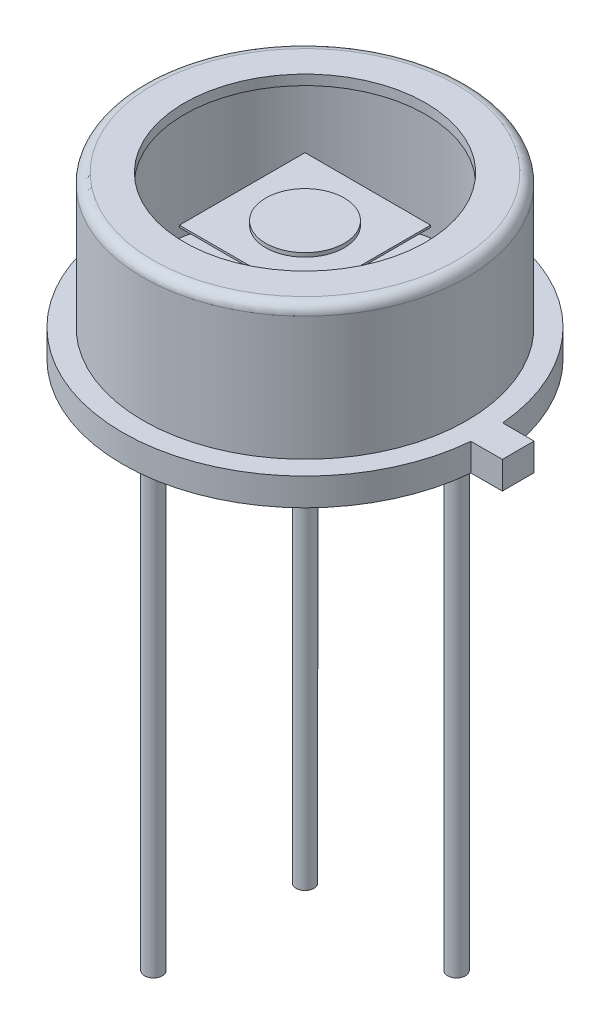
ISO-10303-21;
HEADER;
FILE_DESCRIPTION(('STEP AP214'),'2;1');
FILE_NAME('part.step','',(''),(''),'','','');
FILE_SCHEMA(('AUTOMOTIVE_DESIGN { 1 0 10303 214 1 1 1 1 }'));
ENDSEC;
DATA;
#1=APPLICATION_CONTEXT('core data for automotive mechanical design processes');
#2=APPLICATION_PROTOCOL_DEFINITION('international standard','automotive_design',2000,#1);
#3=PRODUCT_CONTEXT('',#1,'mechanical');
#4=PRODUCT('Part','Part','',(#3));
#5=PRODUCT_RELATED_PRODUCT_CATEGORY('part','',(#4));
#6=PRODUCT_DEFINITION_FORMATION('','',#4);
#7=PRODUCT_DEFINITION_CONTEXT('part definition',#1,'design');
#8=PRODUCT_DEFINITION('design','',#6,#7);
#9=PRODUCT_DEFINITION_SHAPE('','',#8);
#10=(LENGTH_UNIT() NAMED_UNIT(*) SI_UNIT(.MILLI.,.METRE.));
#11=(NAMED_UNIT(*) PLANE_ANGLE_UNIT() SI_UNIT($,.RADIAN.));
#12=(NAMED_UNIT(*) SI_UNIT($,.STERADIAN.) SOLID_ANGLE_UNIT());
#13=UNCERTAINTY_MEASURE_WITH_UNIT(LENGTH_MEASURE(1.E-05),#10,'distance_accuracy_value','');
#14=(GEOMETRIC_REPRESENTATION_CONTEXT(3) GLOBAL_UNCERTAINTY_ASSIGNED_CONTEXT((#13)) GLOBAL_UNIT_ASSIGNED_CONTEXT((#10,
#11,#12)) REPRESENTATION_CONTEXT('',''));
#15=CARTESIAN_POINT('',(0.,0.,0.));
#16=DIRECTION('',(0.,0.,1.));
#17=DIRECTION('',(1.,0.,0.));
#18=AXIS2_PLACEMENT_3D('',#15,#16,#17);
#19=CARTESIAN_POINT('',(-1.6,2.95,-1.6));
#20=DIRECTION('',(0.,-1.,0.));
#21=DIRECTION('',(0.,0.,-1.));
#22=AXIS2_PLACEMENT_3D('',#19,#20,#21);
#23=PLANE('',#22);
#24=DIRECTION('',(0.,0.,-1.));
#25=VECTOR('',#24,1.);
#26=CARTESIAN_POINT('',(-1.6,2.95,1.6));
#27=LINE('',#26,#25);
#28=CARTESIAN_POINT('',(-1.6,2.95,1.6));
#29=VERTEX_POINT('',#28);
#30=CARTESIAN_POINT('',(-1.6,2.95,-1.6));
#31=VERTEX_POINT('',#30);
#32=EDGE_CURVE('E114',#29,#31,#27,.T.);
#33=ORIENTED_EDGE('',*,*,#32,.F.);
#34=DIRECTION('',(-1.,0.,0.));
#35=VECTOR('',#34,1.);
#36=CARTESIAN_POINT('',(-1.6,2.95,1.6));
#37=LINE('',#36,#35);
#38=CARTESIAN_POINT('',(1.6,2.95,1.6));
#39=VERTEX_POINT('',#38);
#40=EDGE_CURVE('E87',#39,#29,#37,.T.);
#41=ORIENTED_EDGE('',*,*,#40,.F.);
#42=DIRECTION('',(0.,0.,1.));
#43=VECTOR('',#42,1.);
#44=CARTESIAN_POINT('',(1.6,2.95,1.6));
#45=LINE('',#44,#43);
#46=CARTESIAN_POINT('',(1.6,2.95,-1.6));
#47=VERTEX_POINT('',#46);
#48=EDGE_CURVE('E81',#47,#39,#45,.T.);
#49=ORIENTED_EDGE('',*,*,#48,.F.);
#50=DIRECTION('',(1.,0.,0.));
#51=VECTOR('',#50,1.);
#52=CARTESIAN_POINT('',(-1.6,2.95,-1.6));
#53=LINE('',#52,#51);
#54=EDGE_CURVE('E105',#31,#47,#53,.T.);
#55=ORIENTED_EDGE('',*,*,#54,.F.);
#56=EDGE_LOOP('',(#33,#41,#49,#55));
#57=FACE_BOUND('',#56,.T.);
#58=CARTESIAN_POINT('',(0.,2.95,0.));
#59=DIRECTION('',(0.,-1.,0.));
#60=DIRECTION('',(0.,0.,-1.));
#61=AXIS2_PLACEMENT_3D('',#58,#59,#60);
#62=CIRCLE('',#61,1.);
#63=CARTESIAN_POINT('',(0.,2.95,-1.));
#64=VERTEX_POINT('',#63);
#65=EDGE_CURVE('E12',#64,#64,#62,.F.);
#66=ORIENTED_EDGE('',*,*,#65,.F.);
#67=EDGE_LOOP('',(#66));
#68=FACE_BOUND('',#67,.T.);
#69=ADVANCED_FACE('F47',(#57,#68),#23,.F.);
#70=CARTESIAN_POINT('',(-1.6,2.9,1.6));
#71=DIRECTION('',(1.,0.,0.));
#72=DIRECTION('',(0.,0.,-1.));
#73=AXIS2_PLACEMENT_3D('',#70,#71,#72);
#74=PLANE('',#73);
#75=ORIENTED_EDGE('',*,*,#32,.T.);
#76=DIRECTION('',(0.,1.,0.));
#77=VECTOR('',#76,1.);
#78=CARTESIAN_POINT('',(-1.6,2.9,-1.6));
#79=LINE('',#78,#77);
#80=CARTESIAN_POINT('',(-1.6,2.9,-1.6));
#81=VERTEX_POINT('',#80);
#82=EDGE_CURVE('E56',#81,#31,#79,.T.);
#83=ORIENTED_EDGE('',*,*,#82,.F.);
#84=DIRECTION('',(0.,0.,-1.));
#85=VECTOR('',#84,1.);
#86=CARTESIAN_POINT('',(-1.6,2.9,1.6));
#87=LINE('',#86,#85);
#88=CARTESIAN_POINT('',(-1.6,2.9,1.6));
#89=VERTEX_POINT('',#88);
#90=EDGE_CURVE('E100',#89,#81,#87,.T.);
#91=ORIENTED_EDGE('',*,*,#90,.F.);
#92=DIRECTION('',(0.,1.,0.));
#93=VECTOR('',#92,1.);
#94=CARTESIAN_POINT('',(-1.6,2.9,1.6));
#95=LINE('',#94,#93);
#96=EDGE_CURVE('E110',#89,#29,#95,.T.);
#97=ORIENTED_EDGE('',*,*,#96,.T.);
#98=EDGE_LOOP('',(#75,#83,#91,#97));
#99=FACE_BOUND('',#98,.T.);
#100=ADVANCED_FACE('F49',(#99),#74,.F.);
#101=CARTESIAN_POINT('',(-1.6,2.9,-1.6));
#102=DIRECTION('',(0.,0.,1.));
#103=DIRECTION('',(1.,0.,0.));
#104=AXIS2_PLACEMENT_3D('',#101,#102,#103);
#105=PLANE('',#104);
#106=ORIENTED_EDGE('',*,*,#54,.T.);
#107=DIRECTION('',(0.,1.,0.));
#108=VECTOR('',#107,1.);
#109=CARTESIAN_POINT('',(1.6,2.9,-1.6));
#110=LINE('',#109,#108);
#111=CARTESIAN_POINT('',(1.6,2.9,-1.6));
#112=VERTEX_POINT('',#111);
#113=EDGE_CURVE('E103',#112,#47,#110,.T.);
#114=ORIENTED_EDGE('',*,*,#113,.F.);
#115=DIRECTION('',(1.,0.,0.));
#116=VECTOR('',#115,1.);
#117=CARTESIAN_POINT('',(-1.6,2.9,-1.6));
#118=LINE('',#117,#116);
#119=EDGE_CURVE('E95',#81,#112,#118,.T.);
#120=ORIENTED_EDGE('',*,*,#119,.F.);
#121=ORIENTED_EDGE('',*,*,#82,.T.);
#122=EDGE_LOOP('',(#106,#114,#120,#121));
#123=FACE_BOUND('',#122,.T.);
#124=ADVANCED_FACE('F104',(#123),#105,.F.);
#125=CARTESIAN_POINT('',(1.6,2.9,1.6));
#126=DIRECTION('',(-1.,0.,0.));
#127=DIRECTION('',(0.,0.,1.));
#128=AXIS2_PLACEMENT_3D('',#125,#126,#127);
#129=PLANE('',#128);
#130=ORIENTED_EDGE('',*,*,#48,.T.);
#131=DIRECTION('',(0.,1.,0.));
#132=VECTOR('',#131,1.);
#133=CARTESIAN_POINT('',(1.6,2.9,1.6));
#134=LINE('',#133,#132);
#135=CARTESIAN_POINT('',(1.6,2.9,1.6));
#136=VERTEX_POINT('',#135);
#137=EDGE_CURVE('E106',#136,#39,#134,.T.);
#138=ORIENTED_EDGE('',*,*,#137,.F.);
#139=DIRECTION('',(0.,0.,1.));
#140=VECTOR('',#139,1.);
#141=CARTESIAN_POINT('',(1.6,2.9,1.6));
#142=LINE('',#141,#140);
#143=EDGE_CURVE('E98',#112,#136,#142,.T.);
#144=ORIENTED_EDGE('',*,*,#143,.F.);
#145=ORIENTED_EDGE('',*,*,#113,.T.);
#146=EDGE_LOOP('',(#130,#138,#144,#145));
#147=FACE_BOUND('',#146,.T.);
#148=ADVANCED_FACE('F108',(#147),#129,.F.);
#149=CARTESIAN_POINT('',(-1.6,2.9,1.6));
#150=DIRECTION('',(0.,0.,-1.));
#151=DIRECTION('',(-1.,0.,0.));
#152=AXIS2_PLACEMENT_3D('',#149,#150,#151);
#153=PLANE('',#152);
#154=ORIENTED_EDGE('',*,*,#40,.T.);
#155=ORIENTED_EDGE('',*,*,#96,.F.);
#156=DIRECTION('',(-1.,0.,0.));
#157=VECTOR('',#156,1.);
#158=CARTESIAN_POINT('',(-1.6,2.9,1.6));
#159=LINE('',#158,#157);
#160=EDGE_CURVE('E64',#136,#89,#159,.T.);
#161=ORIENTED_EDGE('',*,*,#160,.F.);
#162=ORIENTED_EDGE('',*,*,#137,.T.);
#163=EDGE_LOOP('',(#154,#155,#161,#162));
#164=FACE_BOUND('',#163,.T.);
#165=ADVANCED_FACE('F141',(#164),#153,.F.);
#166=CARTESIAN_POINT('',(-1.6,2.9,-1.6));
#167=DIRECTION('',(0.,-1.,0.));
#168=DIRECTION('',(0.,0.,-1.));
#169=AXIS2_PLACEMENT_3D('',#166,#167,#168);
#170=PLANE('',#169);
#171=ORIENTED_EDGE('',*,*,#90,.T.);
#172=ORIENTED_EDGE('',*,*,#119,.T.);
#173=ORIENTED_EDGE('',*,*,#143,.T.);
#174=ORIENTED_EDGE('',*,*,#160,.T.);
#175=EDGE_LOOP('',(#171,#172,#173,#174));
#176=FACE_BOUND('',#175,.T.);
#177=ADVANCED_FACE('F96',(#176),#170,.T.);
#178=CARTESIAN_POINT('',(0.,3.05,0.));
#179=DIRECTION('',(0.,-1.,0.));
#180=DIRECTION('',(0.,0.,-1.));
#181=AXIS2_PLACEMENT_3D('',#178,#179,#180);
#182=CYLINDRICAL_SURFACE('',#181,1.);
#183=CARTESIAN_POINT('',(0.,3.05,0.));
#184=DIRECTION('',(0.,1.,0.));
#185=DIRECTION('',(0.,0.,1.));
#186=AXIS2_PLACEMENT_3D('',#183,#184,#185);
#187=CIRCLE('',#186,1.);
#188=CARTESIAN_POINT('',(0.,3.05,1.));
#189=VERTEX_POINT('',#188);
#190=EDGE_CURVE('E117',#189,#189,#187,.T.);
#191=ORIENTED_EDGE('',*,*,#190,.F.);
#192=EDGE_LOOP('',(#191));
#193=FACE_BOUND('',#192,.T.);
#194=ORIENTED_EDGE('',*,*,#65,.T.);
#195=EDGE_LOOP('',(#194));
#196=FACE_BOUND('',#195,.T.);
#197=ADVANCED_FACE('F130',(#193,#196),#182,.T.);
#198=CARTESIAN_POINT('',(0.,3.05,0.));
#199=DIRECTION('',(0.,1.,0.));
#200=DIRECTION('',(0.,0.,1.));
#201=AXIS2_PLACEMENT_3D('',#198,#199,#200);
#202=PLANE('',#201);
#203=ORIENTED_EDGE('',*,*,#190,.T.);
#204=EDGE_LOOP('',(#203));
#205=FACE_BOUND('',#204,.T.);
#206=ADVANCED_FACE('F132',(#205),#202,.T.);
#207=CLOSED_SHELL('',(#69,#100,#124,#148,#165,#177,#197,#206));
#208=MANIFOLD_SOLID_BREP('B2',#207);
#209=CARTESIAN_POINT('',(4.65,0.,0.));
#210=DIRECTION('',(0.,1.,0.));
#211=DIRECTION('',(0.,0.,1.));
#212=AXIS2_PLACEMENT_3D('',#209,#210,#211);
#213=PLANE('',#212);
#214=CARTESIAN_POINT('',(1.93040151263926,0.,-1.93040151263929));
#215=DIRECTION('',(0.,1.,0.));
#216=DIRECTION('',(0.,0.,1.));
#217=AXIS2_PLACEMENT_3D('',#214,#215,#216);
#218=CIRCLE('',#217,0.23);
#219=CARTESIAN_POINT('',(1.93040151263926,0.,-1.70040151263929));
#220=VERTEX_POINT('',#219);
#221=EDGE_CURVE('E211',#220,#220,#218,.F.);
#222=ORIENTED_EDGE('',*,*,#221,.F.);
#223=EDGE_LOOP('',(#222));
#224=FACE_BOUND('',#223,.T.);
#225=CARTESIAN_POINT('',(0.,0.,0.));
#226=DIRECTION('',(0.,-1.,0.));
#227=DIRECTION('',(0.,0.,-1.));
#228=AXIS2_PLACEMENT_3D('',#225,#226,#227);
#229=CIRCLE('',#228,4.65);
#230=CARTESIAN_POINT('',(4.6323293276709,0.,0.40500000000005));
#231=VERTEX_POINT('',#230);
#232=CARTESIAN_POINT('',(4.63232932767091,0.,-0.40499999999995));
#233=VERTEX_POINT('',#232);
#234=EDGE_CURVE('E218',#231,#233,#229,.T.);
#235=ORIENTED_EDGE('',*,*,#234,.T.);
#236=DIRECTION('',(-1.,0.,0.));
#237=VECTOR('',#236,1.);
#238=CARTESIAN_POINT('',(0.,0.,-0.404999999999999));
#239=LINE('',#238,#237);
#240=CARTESIAN_POINT('',(5.43232932767092,0.,-0.404999999999942));
#241=VERTEX_POINT('',#240);
#242=EDGE_CURVE('E268',#241,#233,#239,.T.);
#243=ORIENTED_EDGE('',*,*,#242,.F.);
#244=DIRECTION('',(0.,0.,1.));
#245=VECTOR('',#244,1.);
#246=CARTESIAN_POINT('',(5.43232932767091,0.,1.16340607579605E-13));
#247=LINE('',#246,#245);
#248=CARTESIAN_POINT('',(5.4323293276709,0.,0.405000000000058));
#249=VERTEX_POINT('',#248);
#250=EDGE_CURVE('E262',#241,#249,#247,.T.);
#251=ORIENTED_EDGE('',*,*,#250,.T.);
#252=DIRECTION('',(-1.,0.,0.));
#253=VECTOR('',#252,1.);
#254=CARTESIAN_POINT('',(0.,0.,0.405000000000001));
#255=LINE('',#254,#253);
#256=EDGE_CURVE('E260',#249,#231,#255,.T.);
#257=ORIENTED_EDGE('',*,*,#256,.T.);
#258=EDGE_LOOP('',(#235,#243,#251,#257));
#259=FACE_BOUND('',#258,.T.);
#260=CARTESIAN_POINT('',(-1.93040151263928,0.,1.93040151263926));
#261=DIRECTION('',(0.,1.,0.));
#262=DIRECTION('',(0.,0.,1.));
#263=AXIS2_PLACEMENT_3D('',#260,#261,#262);
#264=CIRCLE('',#263,0.23);
#265=CARTESIAN_POINT('',(-1.93040151263928,0.,2.16040151263926));
#266=VERTEX_POINT('',#265);
#267=EDGE_CURVE('E296',#266,#266,#264,.F.);
#268=ORIENTED_EDGE('',*,*,#267,.F.);
#269=EDGE_LOOP('',(#268));
#270=FACE_BOUND('',#269,.T.);
#271=CARTESIAN_POINT('',(-1.93040151263929,0.,-1.93040151263929));
#272=DIRECTION('',(0.,1.,0.));
#273=DIRECTION('',(0.,0.,1.));
#274=AXIS2_PLACEMENT_3D('',#271,#272,#273);
#275=CIRCLE('',#274,0.23);
#276=CARTESIAN_POINT('',(-1.93040151263929,0.,-1.70040151263929));
#277=VERTEX_POINT('',#276);
#278=EDGE_CURVE('E45',#277,#277,#275,.F.);
#279=ORIENTED_EDGE('',*,*,#278,.F.);
#280=EDGE_LOOP('',(#279));
#281=FACE_BOUND('',#280,.T.);
#282=ADVANCED_FACE('F203',(#224,#259,#270,#281),#213,.F.);
#283=CARTESIAN_POINT('',(3.871,4.11,0.));
#284=DIRECTION('',(0.,1.,0.));
#285=DIRECTION('',(0.,0.,1.));
#286=AXIS2_PLACEMENT_3D('',#283,#284,#285);
#287=PLANE('',#286);
#288=CARTESIAN_POINT('',(0.,4.11,0.));
#289=DIRECTION('',(0.,-1.,0.));
#290=DIRECTION('',(0.,0.,-1.));
#291=AXIS2_PLACEMENT_3D('',#288,#289,#290);
#292=CIRCLE('',#291,3.075);
#293=CARTESIAN_POINT('',(0.,4.11,-3.075));
#294=VERTEX_POINT('',#293);
#295=EDGE_CURVE('E293',#294,#294,#292,.T.);
#296=ORIENTED_EDGE('',*,*,#295,.T.);
#297=EDGE_LOOP('',(#296));
#298=FACE_BOUND('',#297,.T.);
#299=CARTESIAN_POINT('',(0.,4.11,0.));
#300=DIRECTION('',(0.,-1.,0.));
#301=DIRECTION('',(0.,0.,-1.));
#302=AXIS2_PLACEMENT_3D('',#299,#300,#301);
#303=CIRCLE('',#302,3.871);
#304=CARTESIAN_POINT('',(0.,4.11,-3.871));
#305=VERTEX_POINT('',#304);
#306=EDGE_CURVE('E278',#305,#305,#303,.T.);
#307=ORIENTED_EDGE('',*,*,#306,.F.);
#308=EDGE_LOOP('',(#307));
#309=FACE_BOUND('',#308,.T.);
#310=ADVANCED_FACE('F205',(#298,#309),#287,.T.);
#311=CARTESIAN_POINT('',(0.,0.,0.));
#312=DIRECTION('',(0.,-1.,0.));
#313=DIRECTION('',(0.,0.,-1.));
#314=AXIS2_PLACEMENT_3D('',#311,#312,#313);
#315=CYLINDRICAL_SURFACE('',#314,3.075);
#316=ORIENTED_EDGE('',*,*,#295,.F.);
#317=EDGE_LOOP('',(#316));
#318=FACE_BOUND('',#317,.T.);
#319=CARTESIAN_POINT('',(0.,3.856,0.));
#320=DIRECTION('',(0.,-1.,0.));
#321=DIRECTION('',(0.,0.,-1.));
#322=AXIS2_PLACEMENT_3D('',#319,#320,#321);
#323=CIRCLE('',#322,3.075);
#324=CARTESIAN_POINT('',(0.,3.856,-3.075));
#325=VERTEX_POINT('',#324);
#326=EDGE_CURVE('E290',#325,#325,#323,.T.);
#327=ORIENTED_EDGE('',*,*,#326,.T.);
#328=EDGE_LOOP('',(#327));
#329=FACE_BOUND('',#328,.T.);
#330=ADVANCED_FACE('F373',(#318,#329),#315,.F.);
#331=CARTESIAN_POINT('',(3.871,3.856,0.));
#332=DIRECTION('',(0.,1.,0.));
#333=DIRECTION('',(0.,0.,1.));
#334=AXIS2_PLACEMENT_3D('',#331,#332,#333);
#335=PLANE('',#334);
#336=ORIENTED_EDGE('',*,*,#326,.F.);
#337=EDGE_LOOP('',(#336));
#338=FACE_BOUND('',#337,.T.);
#339=CARTESIAN_POINT('',(0.,3.856,0.));
#340=DIRECTION('',(0.,-1.,0.));
#341=DIRECTION('',(0.,0.,-1.));
#342=AXIS2_PLACEMENT_3D('',#339,#340,#341);
#343=CIRCLE('',#342,3.871);
#344=CARTESIAN_POINT('',(0.,3.856,-3.871));
#345=VERTEX_POINT('',#344);
#346=EDGE_CURVE('E287',#345,#345,#343,.T.);
#347=ORIENTED_EDGE('',*,*,#346,.T.);
#348=EDGE_LOOP('',(#347));
#349=FACE_BOUND('',#348,.T.);
#350=ADVANCED_FACE('F370',(#338,#349),#335,.F.);
#351=CARTESIAN_POINT('',(0.,0.,0.));
#352=DIRECTION('',(0.,-1.,0.));
#353=DIRECTION('',(0.,0.,-1.));
#354=AXIS2_PLACEMENT_3D('',#351,#352,#353);
#355=CYLINDRICAL_SURFACE('',#354,3.871);
#356=ORIENTED_EDGE('',*,*,#346,.F.);
#357=EDGE_LOOP('',(#356));
#358=FACE_BOUND('',#357,.T.);
#359=CARTESIAN_POINT('',(0.,0.446,0.));
#360=DIRECTION('',(0.,1.,0.));
#361=DIRECTION('',(0.,0.,1.));
#362=AXIS2_PLACEMENT_3D('',#359,#360,#361);
#363=CIRCLE('',#362,3.871);
#364=CARTESIAN_POINT('',(0.,0.446,3.871));
#365=VERTEX_POINT('',#364);
#366=EDGE_CURVE('E275',#365,#365,#363,.F.);
#367=ORIENTED_EDGE('',*,*,#366,.T.);
#368=EDGE_LOOP('',(#367));
#369=FACE_BOUND('',#368,.T.);
#370=ADVANCED_FACE('F366',(#358,#369),#355,.F.);
#371=CARTESIAN_POINT('',(0.,0.,0.));
#372=DIRECTION('',(0.,-1.,0.));
#373=DIRECTION('',(0.,0.,-1.));
#374=AXIS2_PLACEMENT_3D('',#371,#372,#373);
#375=CYLINDRICAL_SURFACE('',#374,4.65);
#376=DIRECTION('',(0.,-1.,0.));
#377=VECTOR('',#376,1.);
#378=CARTESIAN_POINT('',(4.6323293276709,1.83846387733649,0.40500000000005));
#379=LINE('',#378,#377);
#380=CARTESIAN_POINT('',(4.6323293276709,0.7,0.40500000000005));
#381=VERTEX_POINT('',#380);
#382=EDGE_CURVE('E251',#381,#231,#379,.T.);
#383=ORIENTED_EDGE('',*,*,#382,.F.);
#384=CARTESIAN_POINT('',(0.,0.7,0.));
#385=DIRECTION('',(0.,-1.,0.));
#386=DIRECTION('',(0.,0.,-1.));
#387=AXIS2_PLACEMENT_3D('',#384,#385,#386);
#388=CIRCLE('',#387,4.65);
#389=CARTESIAN_POINT('',(4.63232932767091,0.7,-0.40499999999995));
#390=VERTEX_POINT('',#389);
#391=EDGE_CURVE('E242',#381,#390,#388,.T.);
#392=ORIENTED_EDGE('',*,*,#391,.T.);
#393=DIRECTION('',(0.,-1.,0.));
#394=VECTOR('',#393,1.);
#395=CARTESIAN_POINT('',(4.63232932767091,1.83846387733649,-0.40499999999995));
#396=LINE('',#395,#394);
#397=EDGE_CURVE('E223',#390,#233,#396,.T.);
#398=ORIENTED_EDGE('',*,*,#397,.T.);
#399=ORIENTED_EDGE('',*,*,#234,.F.);
#400=EDGE_LOOP('',(#383,#392,#398,#399));
#401=FACE_BOUND('',#400,.T.);
#402=ADVANCED_FACE('F252',(#401),#375,.T.);
#403=CARTESIAN_POINT('',(4.65,0.7,0.));
#404=DIRECTION('',(0.,1.,0.));
#405=DIRECTION('',(0.,0.,1.));
#406=AXIS2_PLACEMENT_3D('',#403,#404,#405);
#407=PLANE('',#406);
#408=CARTESIAN_POINT('',(0.,0.7,0.));
#409=DIRECTION('',(0.,-1.,0.));
#410=DIRECTION('',(0.,0.,-1.));
#411=AXIS2_PLACEMENT_3D('',#408,#409,#410);
#412=CIRCLE('',#411,4.125);
#413=CARTESIAN_POINT('',(0.,0.7,-4.125));
#414=VERTEX_POINT('',#413);
#415=EDGE_CURVE('E249',#414,#414,#412,.T.);
#416=ORIENTED_EDGE('',*,*,#415,.T.);
#417=EDGE_LOOP('',(#416));
#418=FACE_BOUND('',#417,.T.);
#419=ORIENTED_EDGE('',*,*,#391,.F.);
#420=DIRECTION('',(-1.,0.,0.));
#421=VECTOR('',#420,1.);
#422=CARTESIAN_POINT('',(0.,0.7,0.405000000000001));
#423=LINE('',#422,#421);
#424=CARTESIAN_POINT('',(5.4323293276709,0.7,0.405000000000058));
#425=VERTEX_POINT('',#424);
#426=EDGE_CURVE('E245',#425,#381,#423,.T.);
#427=ORIENTED_EDGE('',*,*,#426,.F.);
#428=DIRECTION('',(0.,0.,1.));
#429=VECTOR('',#428,1.);
#430=CARTESIAN_POINT('',(5.43232932767091,0.7,1.16340607579605E-13));
#431=LINE('',#430,#429);
#432=CARTESIAN_POINT('',(5.43232932767092,0.7,-0.404999999999942));
#433=VERTEX_POINT('',#432);
#434=EDGE_CURVE('E266',#433,#425,#431,.T.);
#435=ORIENTED_EDGE('',*,*,#434,.F.);
#436=DIRECTION('',(-1.,0.,0.));
#437=VECTOR('',#436,1.);
#438=CARTESIAN_POINT('',(0.,0.7,-0.404999999999999));
#439=LINE('',#438,#437);
#440=EDGE_CURVE('E248',#433,#390,#439,.T.);
#441=ORIENTED_EDGE('',*,*,#440,.T.);
#442=EDGE_LOOP('',(#419,#427,#435,#441));
#443=FACE_BOUND('',#442,.T.);
#444=ADVANCED_FACE('F243',(#418,#443),#407,.T.);
#445=CARTESIAN_POINT('',(0.,0.,0.));
#446=DIRECTION('',(0.,-1.,0.));
#447=DIRECTION('',(0.,0.,-1.));
#448=AXIS2_PLACEMENT_3D('',#445,#446,#447);
#449=CYLINDRICAL_SURFACE('',#448,4.125);
#450=CARTESIAN_POINT('',(0.,3.856,0.));
#451=DIRECTION('',(0.,-1.,0.));
#452=DIRECTION('',(0.,0.,-1.));
#453=AXIS2_PLACEMENT_3D('',#450,#451,#452);
#454=CIRCLE('',#453,4.125);
#455=CARTESIAN_POINT('',(0.,3.856,-4.125));
#456=VERTEX_POINT('',#455);
#457=EDGE_CURVE('E281',#456,#456,#454,.T.);
#458=ORIENTED_EDGE('',*,*,#457,.T.);
#459=EDGE_LOOP('',(#458));
#460=FACE_BOUND('',#459,.T.);
#461=ORIENTED_EDGE('',*,*,#415,.F.);
#462=EDGE_LOOP('',(#461));
#463=FACE_BOUND('',#462,.T.);
#464=ADVANCED_FACE('F357',(#460,#463),#449,.T.);
#465=CARTESIAN_POINT('',(0.,3.856,0.));
#466=DIRECTION('',(0.,-1.,0.));
#467=DIRECTION('',(0.,0.,-1.));
#468=AXIS2_PLACEMENT_3D('',#465,#466,#467);
#469=TOROIDAL_SURFACE('',#468,3.871,0.254);
#470=ORIENTED_EDGE('',*,*,#306,.T.);
#471=EDGE_LOOP('',(#470));
#472=FACE_BOUND('',#471,.T.);
#473=ORIENTED_EDGE('',*,*,#457,.F.);
#474=EDGE_LOOP('',(#473));
#475=FACE_BOUND('',#474,.T.);
#476=ADVANCED_FACE('F353',(#472,#475),#469,.T.);
#477=CARTESIAN_POINT('',(4.65,0.446,0.));
#478=DIRECTION('',(0.,1.,0.));
#479=DIRECTION('',(0.,0.,1.));
#480=AXIS2_PLACEMENT_3D('',#477,#478,#479);
#481=PLANE('',#480);
#482=ORIENTED_EDGE('',*,*,#366,.F.);
#483=EDGE_LOOP('',(#482));
#484=FACE_BOUND('',#483,.T.);
#485=ADVANCED_FACE('F350',(#484),#481,.T.);
#486=CARTESIAN_POINT('',(0.,1.83846387733649,0.405000000000001));
#487=DIRECTION('',(0.,0.,1.));
#488=DIRECTION('',(1.,0.,0.));
#489=AXIS2_PLACEMENT_3D('',#486,#487,#488);
#490=PLANE('',#489);
#491=DIRECTION('',(0.,-1.,0.));
#492=VECTOR('',#491,1.);
#493=CARTESIAN_POINT('',(5.4323293276709,1.83846387733649,0.405000000000058));
#494=LINE('',#493,#492);
#495=EDGE_CURVE('E259',#425,#249,#494,.T.);
#496=ORIENTED_EDGE('',*,*,#495,.F.);
#497=ORIENTED_EDGE('',*,*,#426,.T.);
#498=ORIENTED_EDGE('',*,*,#382,.T.);
#499=ORIENTED_EDGE('',*,*,#256,.F.);
#500=EDGE_LOOP('',(#496,#497,#498,#499));
#501=FACE_BOUND('',#500,.T.);
#502=ADVANCED_FACE('F258',(#501),#490,.T.);
#503=CARTESIAN_POINT('',(0.,1.83846387733649,-0.404999999999999));
#504=DIRECTION('',(0.,0.,1.));
#505=DIRECTION('',(1.,0.,0.));
#506=AXIS2_PLACEMENT_3D('',#503,#504,#505);
#507=PLANE('',#506);
#508=ORIENTED_EDGE('',*,*,#440,.F.);
#509=DIRECTION('',(0.,-1.,0.));
#510=VECTOR('',#509,1.);
#511=CARTESIAN_POINT('',(5.43232932767092,1.83846387733649,-0.404999999999942));
#512=LINE('',#511,#510);
#513=EDGE_CURVE('E271',#433,#241,#512,.T.);
#514=ORIENTED_EDGE('',*,*,#513,.T.);
#515=ORIENTED_EDGE('',*,*,#242,.T.);
#516=ORIENTED_EDGE('',*,*,#397,.F.);
#517=EDGE_LOOP('',(#508,#514,#515,#516));
#518=FACE_BOUND('',#517,.T.);
#519=ADVANCED_FACE('F343',(#518),#507,.F.);
#520=CARTESIAN_POINT('',(5.43232932767091,1.83846387733649,1.16340607579605E-13));
#521=DIRECTION('',(1.,0.,0.));
#522=DIRECTION('',(0.,0.,-1.));
#523=AXIS2_PLACEMENT_3D('',#520,#521,#522);
#524=PLANE('',#523);
#525=ORIENTED_EDGE('',*,*,#513,.F.);
#526=ORIENTED_EDGE('',*,*,#434,.T.);
#527=ORIENTED_EDGE('',*,*,#495,.T.);
#528=ORIENTED_EDGE('',*,*,#250,.F.);
#529=EDGE_LOOP('',(#525,#526,#527,#528));
#530=FACE_BOUND('',#529,.T.);
#531=ADVANCED_FACE('F339',(#530),#524,.T.);
#532=CARTESIAN_POINT('',(-1.93040151263928,-13.5,1.93040151263926));
#533=DIRECTION('',(0.,1.,0.));
#534=DIRECTION('',(0.,0.,1.));
#535=AXIS2_PLACEMENT_3D('',#532,#533,#534);
#536=CYLINDRICAL_SURFACE('',#535,0.23);
#537=CARTESIAN_POINT('',(-1.93040151263928,-13.5,1.93040151263926));
#538=DIRECTION('',(0.,-1.,0.));
#539=DIRECTION('',(0.,0.,-1.));
#540=AXIS2_PLACEMENT_3D('',#537,#538,#539);
#541=CIRCLE('',#540,0.23);
#542=CARTESIAN_POINT('',(-1.93040151263928,-13.5,1.70040151263926));
#543=VERTEX_POINT('',#542);
#544=EDGE_CURVE('E270',#543,#543,#541,.T.);
#545=ORIENTED_EDGE('',*,*,#544,.F.);
#546=EDGE_LOOP('',(#545));
#547=FACE_BOUND('',#546,.T.);
#548=ORIENTED_EDGE('',*,*,#267,.T.);
#549=EDGE_LOOP('',(#548));
#550=FACE_BOUND('',#549,.T.);
#551=ADVANCED_FACE('F335',(#547,#550),#536,.T.);
#552=CARTESIAN_POINT('',(-1.93040151263928,-13.5,1.93040151263926));
#553=DIRECTION('',(0.,-1.,0.));
#554=DIRECTION('',(0.,0.,-1.));
#555=AXIS2_PLACEMENT_3D('',#552,#553,#554);
#556=PLANE('',#555);
#557=ORIENTED_EDGE('',*,*,#544,.T.);
#558=EDGE_LOOP('',(#557));
#559=FACE_BOUND('',#558,.T.);
#560=ADVANCED_FACE('F331',(#559),#556,.T.);
#561=CARTESIAN_POINT('',(1.93040151263926,-13.5,-1.93040151263929));
#562=DIRECTION('',(0.,1.,0.));
#563=DIRECTION('',(0.,0.,1.));
#564=AXIS2_PLACEMENT_3D('',#561,#562,#563);
#565=CYLINDRICAL_SURFACE('',#564,0.23);
#566=CARTESIAN_POINT('',(1.93040151263926,-13.5,-1.93040151263929));
#567=DIRECTION('',(0.,-1.,0.));
#568=DIRECTION('',(0.,0.,-1.));
#569=AXIS2_PLACEMENT_3D('',#566,#567,#568);
#570=CIRCLE('',#569,0.23);
#571=CARTESIAN_POINT('',(1.93040151263926,-13.5,-2.16040151263929));
#572=VERTEX_POINT('',#571);
#573=EDGE_CURVE('E525',#572,#572,#570,.T.);
#574=ORIENTED_EDGE('',*,*,#573,.F.);
#575=EDGE_LOOP('',(#574));
#576=FACE_BOUND('',#575,.T.);
#577=ORIENTED_EDGE('',*,*,#221,.T.);
#578=EDGE_LOOP('',(#577));
#579=FACE_BOUND('',#578,.T.);
#580=ADVANCED_FACE('F301',(#576,#579),#565,.T.);
#581=CARTESIAN_POINT('',(1.93040151263926,-13.5,-1.93040151263929));
#582=DIRECTION('',(0.,-1.,0.));
#583=DIRECTION('',(0.,0.,-1.));
#584=AXIS2_PLACEMENT_3D('',#581,#582,#583);
#585=PLANE('',#584);
#586=ORIENTED_EDGE('',*,*,#573,.T.);
#587=EDGE_LOOP('',(#586));
#588=FACE_BOUND('',#587,.T.);
#589=ADVANCED_FACE('F316',(#588),#585,.T.);
#590=CARTESIAN_POINT('',(-1.93040151263929,-13.5,-1.93040151263929));
#591=DIRECTION('',(0.,1.,0.));
#592=DIRECTION('',(0.,0.,1.));
#593=AXIS2_PLACEMENT_3D('',#590,#591,#592);
#594=CYLINDRICAL_SURFACE('',#593,0.23);
#595=CARTESIAN_POINT('',(-1.93040151263929,-13.5,-1.93040151263929));
#596=DIRECTION('',(0.,-1.,0.));
#597=DIRECTION('',(0.,0.,-1.));
#598=AXIS2_PLACEMENT_3D('',#595,#596,#597);
#599=CIRCLE('',#598,0.23);
#600=CARTESIAN_POINT('',(-1.93040151263929,-13.5,-2.16040151263929));
#601=VERTEX_POINT('',#600);
#602=EDGE_CURVE('E528',#601,#601,#599,.T.);
#603=ORIENTED_EDGE('',*,*,#602,.F.);
#604=EDGE_LOOP('',(#603));
#605=FACE_BOUND('',#604,.T.);
#606=ORIENTED_EDGE('',*,*,#278,.T.);
#607=EDGE_LOOP('',(#606));
#608=FACE_BOUND('',#607,.T.);
#609=ADVANCED_FACE('F313',(#605,#608),#594,.T.);
#610=CARTESIAN_POINT('',(-1.93040151263929,-13.5,-1.93040151263929));
#611=DIRECTION('',(0.,-1.,0.));
#612=DIRECTION('',(0.,0.,-1.));
#613=AXIS2_PLACEMENT_3D('',#610,#611,#612);
#614=PLANE('',#613);
#615=ORIENTED_EDGE('',*,*,#602,.T.);
#616=EDGE_LOOP('',(#615));
#617=FACE_BOUND('',#616,.T.);
#618=ADVANCED_FACE('F315',(#617),#614,.T.);
#619=CLOSED_SHELL('',(#282,#310,#330,#350,#370,#402,#444,#464,#476,#485,#502,#519,#531,#551,
#560,#580,#589,#609,#618));
#620=MANIFOLD_SOLID_BREP('B6',#619);
#621=ADVANCED_BREP_SHAPE_REPRESENTATION('',(#18,#208,#620),#14);
#622=SHAPE_DEFINITION_REPRESENTATION(#9,#621);
ENDSEC;
END-ISO-10303-21;
